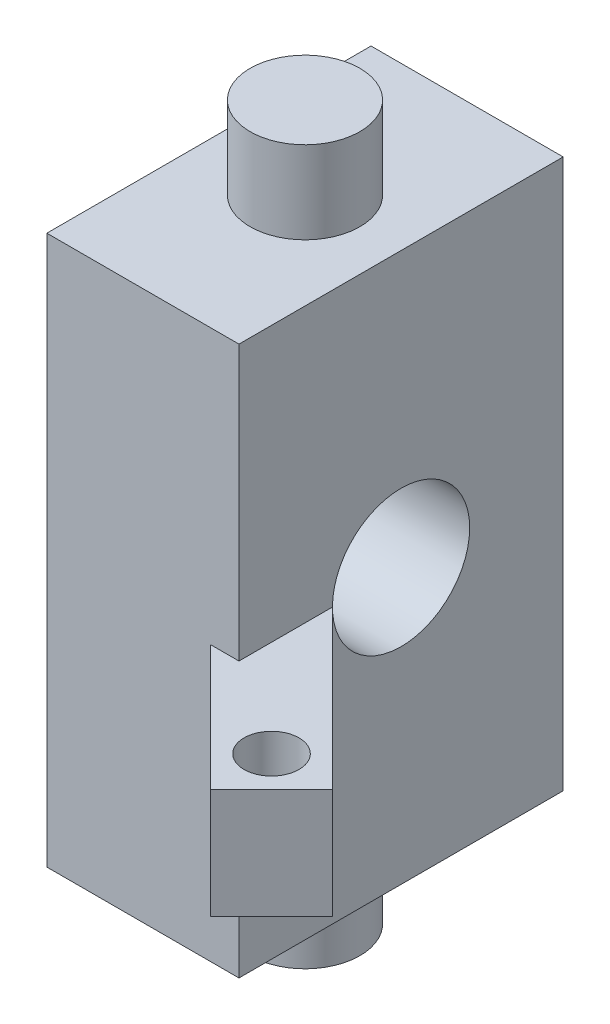
ISO-10303-21;
HEADER;
FILE_DESCRIPTION(('STEP AP214'),'2;1');
FILE_NAME('part.step','',(''),(''),'','','');
FILE_SCHEMA(('AUTOMOTIVE_DESIGN { 1 0 10303 214 1 1 1 1 }'));
ENDSEC;
DATA;
#1=APPLICATION_CONTEXT('core data for automotive mechanical design processes');
#2=APPLICATION_PROTOCOL_DEFINITION('international standard','automotive_design',2000,#1);
#3=PRODUCT_CONTEXT('',#1,'mechanical');
#4=PRODUCT('Part','Part','',(#3));
#5=PRODUCT_RELATED_PRODUCT_CATEGORY('part','',(#4));
#6=PRODUCT_DEFINITION_FORMATION('','',#4);
#7=PRODUCT_DEFINITION_CONTEXT('part definition',#1,'design');
#8=PRODUCT_DEFINITION('design','',#6,#7);
#9=PRODUCT_DEFINITION_SHAPE('','',#8);
#10=(LENGTH_UNIT() NAMED_UNIT(*) SI_UNIT(.MILLI.,.METRE.));
#11=(NAMED_UNIT(*) PLANE_ANGLE_UNIT() SI_UNIT($,.RADIAN.));
#12=(NAMED_UNIT(*) SI_UNIT($,.STERADIAN.) SOLID_ANGLE_UNIT());
#13=UNCERTAINTY_MEASURE_WITH_UNIT(LENGTH_MEASURE(1.E-05),#10,'distance_accuracy_value','');
#14=(GEOMETRIC_REPRESENTATION_CONTEXT(3) GLOBAL_UNCERTAINTY_ASSIGNED_CONTEXT((#13)) GLOBAL_UNIT_ASSIGNED_CONTEXT((#10,
#11,#12)) REPRESENTATION_CONTEXT('',''));
#15=CARTESIAN_POINT('',(0.,0.,0.));
#16=DIRECTION('',(0.,0.,1.));
#17=DIRECTION('',(1.,0.,0.));
#18=AXIS2_PLACEMENT_3D('',#15,#16,#17);
#19=CARTESIAN_POINT('',(0.,-16.51,7.499999986));
#20=DIRECTION('',(0.,0.,1.));
#21=DIRECTION('',(1.,0.,0.));
#22=AXIS2_PLACEMENT_3D('',#19,#20,#21);
#23=PLANE('',#22);
#24=DIRECTION('',(0.,1.,0.));
#25=VECTOR('',#24,1.);
#26=CARTESIAN_POINT('',(-4.445,-16.51,7.499999986));
#27=LINE('',#26,#25);
#28=CARTESIAN_POINT('',(-4.445,-12.7,7.499999986));
#29=VERTEX_POINT('',#28);
#30=CARTESIAN_POINT('',(-4.445,12.7,7.499999986));
#31=VERTEX_POINT('',#30);
#32=EDGE_CURVE('E153',#29,#31,#27,.T.);
#33=ORIENTED_EDGE('',*,*,#32,.F.);
#34=DIRECTION('',(1.,0.,0.));
#35=VECTOR('',#34,1.);
#36=CARTESIAN_POINT('',(0.,-12.7,7.499999986));
#37=LINE('',#36,#35);
#38=CARTESIAN_POINT('',(4.445,-12.7,7.499999986));
#39=VERTEX_POINT('',#38);
#40=EDGE_CURVE('E177',#29,#39,#37,.T.);
#41=ORIENTED_EDGE('',*,*,#40,.T.);
#42=DIRECTION('',(0.,1.,0.));
#43=VECTOR('',#42,1.);
#44=CARTESIAN_POINT('',(4.445,-16.51,7.499999986));
#45=LINE('',#44,#43);
#46=CARTESIAN_POINT('',(4.445,-5.08,7.499999986));
#47=VERTEX_POINT('',#46);
#48=EDGE_CURVE('E160',#39,#47,#45,.T.);
#49=ORIENTED_EDGE('',*,*,#48,.T.);
#50=DIRECTION('',(1.,0.,0.));
#51=VECTOR('',#50,1.);
#52=CARTESIAN_POINT('',(0.,-5.08,7.499999986));
#53=LINE('',#52,#51);
#54=CARTESIAN_POINT('',(3.12330113434391,-5.08,7.499999986));
#55=VERTEX_POINT('',#54);
#56=EDGE_CURVE('E152',#55,#47,#53,.T.);
#57=ORIENTED_EDGE('',*,*,#56,.F.);
#58=DIRECTION('',(0.,1.,0.));
#59=VECTOR('',#58,1.);
#60=CARTESIAN_POINT('',(3.12330113434391,-5.08,7.499999986));
#61=LINE('',#60,#59);
#62=CARTESIAN_POINT('',(3.12330113434391,0.,7.499999986));
#63=VERTEX_POINT('',#62);
#64=EDGE_CURVE('E143',#55,#63,#61,.T.);
#65=ORIENTED_EDGE('',*,*,#64,.T.);
#66=DIRECTION('',(1.,0.,0.));
#67=VECTOR('',#66,1.);
#68=CARTESIAN_POINT('',(0.,0.,7.499999986));
#69=LINE('',#68,#67);
#70=CARTESIAN_POINT('',(4.445,0.,7.499999986));
#71=VERTEX_POINT('',#70);
#72=EDGE_CURVE('E134',#63,#71,#69,.T.);
#73=ORIENTED_EDGE('',*,*,#72,.T.);
#74=CARTESIAN_POINT('',(4.445,12.7,7.499999986));
#75=VERTEX_POINT('',#74);
#76=EDGE_CURVE('E145',#71,#75,#45,.T.);
#77=ORIENTED_EDGE('',*,*,#76,.T.);
#78=DIRECTION('',(-1.,0.,0.));
#79=VECTOR('',#78,1.);
#80=CARTESIAN_POINT('',(0.,12.7,7.499999986));
#81=LINE('',#80,#79);
#82=EDGE_CURVE('E194',#75,#31,#81,.T.);
#83=ORIENTED_EDGE('',*,*,#82,.T.);
#84=EDGE_LOOP('',(#33,#41,#49,#57,#65,#73,#77,#83));
#85=FACE_BOUND('',#84,.T.);
#86=ADVANCED_FACE('F37',(#85),#23,.T.);
#87=CARTESIAN_POINT('',(4.445,-16.51,0.));
#88=DIRECTION('',(1.,0.,0.));
#89=DIRECTION('',(0.,0.,-1.));
#90=AXIS2_PLACEMENT_3D('',#87,#88,#89);
#91=PLANE('',#90);
#92=CARTESIAN_POINT('',(4.445,0.,0.));
#93=DIRECTION('',(1.,0.,0.));
#94=DIRECTION('',(0.,0.,-1.));
#95=AXIS2_PLACEMENT_3D('',#92,#93,#94);
#96=CIRCLE('',#95,3.175);
#97=CARTESIAN_POINT('',(4.445,-0.253739323234173,3.16484460216369));
#98=VERTEX_POINT('',#97);
#99=CARTESIAN_POINT('',(4.445,0.,3.175));
#100=VERTEX_POINT('',#99);
#101=EDGE_CURVE('E50',#98,#100,#96,.T.);
#102=ORIENTED_EDGE('',*,*,#101,.F.);
#103=DIRECTION('',(0.,1.,0.));
#104=VECTOR('',#103,1.);
#105=CARTESIAN_POINT('',(4.445,-5.08,3.16484460216369));
#106=LINE('',#105,#104);
#107=CARTESIAN_POINT('',(4.445,-5.08,3.16484460216369));
#108=VERTEX_POINT('',#107);
#109=EDGE_CURVE('E124',#108,#98,#106,.T.);
#110=ORIENTED_EDGE('',*,*,#109,.F.);
#111=DIRECTION('',(0.,0.,-1.));
#112=VECTOR('',#111,1.);
#113=CARTESIAN_POINT('',(4.445,-5.08,0.));
#114=LINE('',#113,#112);
#115=EDGE_CURVE('E212',#47,#108,#114,.T.);
#116=ORIENTED_EDGE('',*,*,#115,.F.);
#117=ORIENTED_EDGE('',*,*,#48,.F.);
#118=DIRECTION('',(0.,0.,-1.));
#119=VECTOR('',#118,1.);
#120=CARTESIAN_POINT('',(4.445,-12.7,0.));
#121=LINE('',#120,#119);
#122=CARTESIAN_POINT('',(4.445,-12.7,-7.499999986));
#123=VERTEX_POINT('',#122);
#124=EDGE_CURVE('E166',#39,#123,#121,.T.);
#125=ORIENTED_EDGE('',*,*,#124,.T.);
#126=DIRECTION('',(0.,1.,0.));
#127=VECTOR('',#126,1.);
#128=CARTESIAN_POINT('',(4.445,-16.51,-7.499999986));
#129=LINE('',#128,#127);
#130=CARTESIAN_POINT('',(4.445,12.7,-7.499999986));
#131=VERTEX_POINT('',#130);
#132=EDGE_CURVE('E158',#123,#131,#129,.T.);
#133=ORIENTED_EDGE('',*,*,#132,.T.);
#134=DIRECTION('',(0.,0.,1.));
#135=VECTOR('',#134,1.);
#136=CARTESIAN_POINT('',(4.445,12.7,0.));
#137=LINE('',#136,#135);
#138=EDGE_CURVE('E188',#131,#75,#137,.T.);
#139=ORIENTED_EDGE('',*,*,#138,.T.);
#140=ORIENTED_EDGE('',*,*,#76,.F.);
#141=DIRECTION('',(0.,0.,-1.));
#142=VECTOR('',#141,1.);
#143=CARTESIAN_POINT('',(4.445,0.,0.));
#144=LINE('',#143,#142);
#145=EDGE_CURVE('E132',#71,#100,#144,.T.);
#146=ORIENTED_EDGE('',*,*,#145,.T.);
#147=EDGE_LOOP('',(#102,#110,#116,#117,#125,#133,#139,#140,#146));
#148=FACE_BOUND('',#147,.T.);
#149=ADVANCED_FACE('F173',(#148),#91,.T.);
#150=CARTESIAN_POINT('',(-4.445,-16.51,0.));
#151=DIRECTION('',(-1.,0.,0.));
#152=DIRECTION('',(0.,0.,1.));
#153=AXIS2_PLACEMENT_3D('',#150,#151,#152);
#154=PLANE('',#153);
#155=CARTESIAN_POINT('',(-4.445,0.,0.));
#156=DIRECTION('',(1.,0.,0.));
#157=DIRECTION('',(0.,0.,-1.));
#158=AXIS2_PLACEMENT_3D('',#155,#156,#157);
#159=CIRCLE('',#158,3.175);
#160=CARTESIAN_POINT('',(-4.445,0.,-3.175));
#161=VERTEX_POINT('',#160);
#162=EDGE_CURVE('E125',#161,#161,#159,.T.);
#163=ORIENTED_EDGE('',*,*,#162,.T.);
#164=EDGE_LOOP('',(#163));
#165=FACE_BOUND('',#164,.T.);
#166=DIRECTION('',(0.,1.,0.));
#167=VECTOR('',#166,1.);
#168=CARTESIAN_POINT('',(-4.445,-16.51,-7.499999986));
#169=LINE('',#168,#167);
#170=CARTESIAN_POINT('',(-4.445,-12.7,-7.499999986));
#171=VERTEX_POINT('',#170);
#172=CARTESIAN_POINT('',(-4.445,12.7,-7.499999986));
#173=VERTEX_POINT('',#172);
#174=EDGE_CURVE('E156',#171,#173,#169,.T.);
#175=ORIENTED_EDGE('',*,*,#174,.F.);
#176=DIRECTION('',(0.,0.,1.));
#177=VECTOR('',#176,1.);
#178=CARTESIAN_POINT('',(-4.445,-12.7,0.));
#179=LINE('',#178,#177);
#180=EDGE_CURVE('E58',#171,#29,#179,.T.);
#181=ORIENTED_EDGE('',*,*,#180,.T.);
#182=ORIENTED_EDGE('',*,*,#32,.T.);
#183=DIRECTION('',(0.,0.,-1.));
#184=VECTOR('',#183,1.);
#185=CARTESIAN_POINT('',(-4.445,12.7,0.));
#186=LINE('',#185,#184);
#187=EDGE_CURVE('E186',#31,#173,#186,.T.);
#188=ORIENTED_EDGE('',*,*,#187,.T.);
#189=EDGE_LOOP('',(#175,#181,#182,#188));
#190=FACE_BOUND('',#189,.T.);
#191=ADVANCED_FACE('F190',(#165,#190),#154,.T.);
#192=CARTESIAN_POINT('',(0.,-16.51,-7.499999986));
#193=DIRECTION('',(0.,0.,1.));
#194=DIRECTION('',(1.,0.,0.));
#195=AXIS2_PLACEMENT_3D('',#192,#193,#194);
#196=PLANE('',#195);
#197=DIRECTION('',(1.,0.,0.));
#198=VECTOR('',#197,1.);
#199=CARTESIAN_POINT('',(0.,-12.7,-7.499999986));
#200=LINE('',#199,#198);
#201=EDGE_CURVE('E44',#171,#123,#200,.T.);
#202=ORIENTED_EDGE('',*,*,#201,.F.);
#203=ORIENTED_EDGE('',*,*,#174,.T.);
#204=DIRECTION('',(-1.,0.,0.));
#205=VECTOR('',#204,1.);
#206=CARTESIAN_POINT('',(0.,12.7,-7.499999986));
#207=LINE('',#206,#205);
#208=EDGE_CURVE('E155',#131,#173,#207,.T.);
#209=ORIENTED_EDGE('',*,*,#208,.F.);
#210=ORIENTED_EDGE('',*,*,#132,.F.);
#211=EDGE_LOOP('',(#202,#203,#209,#210));
#212=FACE_BOUND('',#211,.T.);
#213=ADVANCED_FACE('F180',(#212),#196,.F.);
#214=CARTESIAN_POINT('',(-2.18834942582803,-5.08,2.18834942582801));
#215=DIRECTION('',(0.707106781186551,0.,-0.707106781186544));
#216=DIRECTION('',(-0.707106781186544,0.,-0.707106781186551));
#217=AXIS2_PLACEMENT_3D('',#214,#215,#216);
#218=PLANE('',#217);
#219=DIRECTION('',(-0.707106781186544,0.,-0.707106781186551));
#220=VECTOR('',#219,1.);
#221=CARTESIAN_POINT('',(-2.18834942582803,0.,2.18834942582801));
#222=LINE('',#221,#220);
#223=CARTESIAN_POINT('',(8.93223605551142,0.,13.3089349071676));
#224=VERTEX_POINT('',#223);
#225=EDGE_CURVE('E136',#224,#63,#222,.T.);
#226=ORIENTED_EDGE('',*,*,#225,.T.);
#227=ORIENTED_EDGE('',*,*,#64,.F.);
#228=DIRECTION('',(-0.707106781186544,0.,-0.707106781186551));
#229=VECTOR('',#228,1.);
#230=CARTESIAN_POINT('',(-2.18834942582803,-5.08,2.18834942582801));
#231=LINE('',#230,#229);
#232=CARTESIAN_POINT('',(8.93223605551142,-5.08,13.3089349071676));
#233=VERTEX_POINT('',#232);
#234=EDGE_CURVE('E205',#233,#55,#231,.T.);
#235=ORIENTED_EDGE('',*,*,#234,.F.);
#236=DIRECTION('',(0.,1.,0.));
#237=VECTOR('',#236,1.);
#238=CARTESIAN_POINT('',(8.93223605551142,-5.08,13.3089349071676));
#239=LINE('',#238,#237);
#240=EDGE_CURVE('E149',#233,#224,#239,.T.);
#241=ORIENTED_EDGE('',*,*,#240,.T.);
#242=EDGE_LOOP('',(#226,#227,#235,#241));
#243=FACE_BOUND('',#242,.T.);
#244=ADVANCED_FACE('F221',(#243),#218,.F.);
#245=CARTESIAN_POINT('',(0.640077698918177,-5.08,-0.64007769891817));
#246=DIRECTION('',(-0.707106781186551,0.,0.707106781186544));
#247=DIRECTION('',(0.707106781186544,0.,0.707106781186551));
#248=AXIS2_PLACEMENT_3D('',#245,#246,#247);
#249=PLANE('',#248);
#250=ORIENTED_EDGE('',*,*,#109,.T.);
#251=CARTESIAN_POINT('',(1.28015539783634,0.,0.));
#252=DIRECTION('',(-0.707106781186551,0.,0.707106781186544));
#253=DIRECTION('',(0.707106781186544,0.,0.707106781186551));
#254=AXIS2_PLACEMENT_3D('',#251,#252,#253);
#255=ELLIPSE('',#254,4.49012806053455,3.175);
#256=CARTESIAN_POINT('',(4.45515539783631,0.,3.175));
#257=VERTEX_POINT('',#256);
#258=EDGE_CURVE('E112',#98,#257,#255,.T.);
#259=ORIENTED_EDGE('',*,*,#258,.T.);
#260=DIRECTION('',(0.707106781186544,0.,0.707106781186551));
#261=VECTOR('',#260,1.);
#262=CARTESIAN_POINT('',(0.640077698918177,0.,-0.64007769891817));
#263=LINE('',#262,#261);
#264=CARTESIAN_POINT('',(11.7606631802576,0.,10.4805077824214));
#265=VERTEX_POINT('',#264);
#266=EDGE_CURVE('E121',#257,#265,#263,.T.);
#267=ORIENTED_EDGE('',*,*,#266,.T.);
#268=DIRECTION('',(0.,1.,0.));
#269=VECTOR('',#268,1.);
#270=CARTESIAN_POINT('',(11.7606631802576,-5.08,10.4805077824214));
#271=LINE('',#270,#269);
#272=CARTESIAN_POINT('',(11.7606631802576,-5.08,10.4805077824214));
#273=VERTEX_POINT('',#272);
#274=EDGE_CURVE('E147',#273,#265,#271,.T.);
#275=ORIENTED_EDGE('',*,*,#274,.F.);
#276=DIRECTION('',(0.707106781186544,0.,0.707106781186551));
#277=VECTOR('',#276,1.);
#278=CARTESIAN_POINT('',(0.640077698918177,-5.08,-0.64007769891817));
#279=LINE('',#278,#277);
#280=EDGE_CURVE('E210',#108,#273,#279,.T.);
#281=ORIENTED_EDGE('',*,*,#280,.F.);
#282=EDGE_LOOP('',(#250,#259,#267,#275,#281));
#283=FACE_BOUND('',#282,.T.);
#284=ADVANCED_FACE('F119',(#283),#249,.F.);
#285=CARTESIAN_POINT('',(8.90960863851346,-5.08,10.4578803654234));
#286=DIRECTION('',(0.,1.,0.));
#287=DIRECTION('',(0.,0.,1.));
#288=AXIS2_PLACEMENT_3D('',#285,#286,#287);
#289=CYLINDRICAL_SURFACE('',#288,1.27);
#290=CARTESIAN_POINT('',(8.90960863851346,-5.08,10.4578803654234));
#291=DIRECTION('',(0.,1.,0.));
#292=DIRECTION('',(0.,0.,1.));
#293=AXIS2_PLACEMENT_3D('',#290,#291,#292);
#294=CIRCLE('',#293,1.27);
#295=CARTESIAN_POINT('',(8.90960863851346,-5.08,11.7278803654234));
#296=VERTEX_POINT('',#295);
#297=EDGE_CURVE('E142',#296,#296,#294,.T.);
#298=ORIENTED_EDGE('',*,*,#297,.F.);
#299=EDGE_LOOP('',(#298));
#300=FACE_BOUND('',#299,.T.);
#301=CARTESIAN_POINT('',(8.90960863851346,0.,10.4578803654234));
#302=DIRECTION('',(0.,1.,0.));
#303=DIRECTION('',(0.,0.,1.));
#304=AXIS2_PLACEMENT_3D('',#301,#302,#303);
#305=CIRCLE('',#304,1.27);
#306=CARTESIAN_POINT('',(8.90960863851346,0.,11.7278803654234));
#307=VERTEX_POINT('',#306);
#308=EDGE_CURVE('E202',#307,#307,#305,.T.);
#309=ORIENTED_EDGE('',*,*,#308,.T.);
#310=EDGE_LOOP('',(#309));
#311=FACE_BOUND('',#310,.T.);
#312=ADVANCED_FACE('F233',(#300,#311),#289,.F.);
#313=CARTESIAN_POINT('',(11.1205854813394,-5.08,11.1205854813396));
#314=DIRECTION('',(-0.707106781186544,0.,-0.707106781186551));
#315=DIRECTION('',(-0.707106781186551,0.,0.707106781186544));
#316=AXIS2_PLACEMENT_3D('',#313,#314,#315);
#317=PLANE('',#316);
#318=DIRECTION('',(-0.707106781186551,0.,0.707106781186544));
#319=VECTOR('',#318,1.);
#320=CARTESIAN_POINT('',(11.1205854813394,0.,11.1205854813396));
#321=LINE('',#320,#319);
#322=EDGE_CURVE('E131',#265,#224,#321,.T.);
#323=ORIENTED_EDGE('',*,*,#322,.T.);
#324=ORIENTED_EDGE('',*,*,#240,.F.);
#325=DIRECTION('',(-0.707106781186551,0.,0.707106781186544));
#326=VECTOR('',#325,1.);
#327=CARTESIAN_POINT('',(11.1205854813394,-5.08,11.1205854813396));
#328=LINE('',#327,#326);
#329=EDGE_CURVE('E208',#273,#233,#328,.T.);
#330=ORIENTED_EDGE('',*,*,#329,.F.);
#331=ORIENTED_EDGE('',*,*,#274,.T.);
#332=EDGE_LOOP('',(#323,#324,#330,#331));
#333=FACE_BOUND('',#332,.T.);
#334=ADVANCED_FACE('F231',(#333),#317,.F.);
#335=CARTESIAN_POINT('',(0.,-5.08,0.));
#336=DIRECTION('',(0.,1.,0.));
#337=DIRECTION('',(0.,0.,1.));
#338=AXIS2_PLACEMENT_3D('',#335,#336,#337);
#339=PLANE('',#338);
#340=ORIENTED_EDGE('',*,*,#297,.T.);
#341=EDGE_LOOP('',(#340));
#342=FACE_BOUND('',#341,.T.);
#343=ORIENTED_EDGE('',*,*,#234,.T.);
#344=ORIENTED_EDGE('',*,*,#56,.T.);
#345=ORIENTED_EDGE('',*,*,#115,.T.);
#346=ORIENTED_EDGE('',*,*,#280,.T.);
#347=ORIENTED_EDGE('',*,*,#329,.T.);
#348=EDGE_LOOP('',(#343,#344,#345,#346,#347));
#349=FACE_BOUND('',#348,.T.);
#350=ADVANCED_FACE('F228',(#342,#349),#339,.F.);
#351=CARTESIAN_POINT('',(0.,0.,0.));
#352=DIRECTION('',(0.,1.,0.));
#353=DIRECTION('',(0.,0.,1.));
#354=AXIS2_PLACEMENT_3D('',#351,#352,#353);
#355=PLANE('',#354);
#356=DIRECTION('',(1.,0.,0.));
#357=VECTOR('',#356,1.);
#358=CARTESIAN_POINT('',(-4.445,0.,3.175));
#359=LINE('',#358,#357);
#360=EDGE_CURVE('E11',#100,#257,#359,.T.);
#361=ORIENTED_EDGE('',*,*,#360,.F.);
#362=ORIENTED_EDGE('',*,*,#145,.F.);
#363=ORIENTED_EDGE('',*,*,#72,.F.);
#364=ORIENTED_EDGE('',*,*,#225,.F.);
#365=ORIENTED_EDGE('',*,*,#322,.F.);
#366=ORIENTED_EDGE('',*,*,#266,.F.);
#367=EDGE_LOOP('',(#361,#362,#363,#364,#365,#366));
#368=FACE_BOUND('',#367,.T.);
#369=ORIENTED_EDGE('',*,*,#308,.F.);
#370=EDGE_LOOP('',(#369));
#371=FACE_BOUND('',#370,.T.);
#372=ADVANCED_FACE('F128',(#368,#371),#355,.T.);
#373=CARTESIAN_POINT('',(0.,0.,0.));
#374=DIRECTION('',(0.,-1.,0.));
#375=DIRECTION('',(0.,0.,-1.));
#376=AXIS2_PLACEMENT_3D('',#373,#374,#375);
#377=CYLINDRICAL_SURFACE('',#376,2.54);
#378=CARTESIAN_POINT('',(0.,16.51,0.));
#379=DIRECTION('',(0.,-1.,0.));
#380=DIRECTION('',(0.,0.,-1.));
#381=AXIS2_PLACEMENT_3D('',#378,#379,#380);
#382=CIRCLE('',#381,2.54);
#383=CARTESIAN_POINT('',(0.,16.51,-2.54));
#384=VERTEX_POINT('',#383);
#385=EDGE_CURVE('E197',#384,#384,#382,.T.);
#386=ORIENTED_EDGE('',*,*,#385,.T.);
#387=EDGE_LOOP('',(#386));
#388=FACE_BOUND('',#387,.T.);
#389=CARTESIAN_POINT('',(0.,12.7,0.));
#390=DIRECTION('',(0.,-1.,0.));
#391=DIRECTION('',(0.,0.,-1.));
#392=AXIS2_PLACEMENT_3D('',#389,#390,#391);
#393=CIRCLE('',#392,2.54);
#394=CARTESIAN_POINT('',(0.,12.7,-2.54));
#395=VERTEX_POINT('',#394);
#396=EDGE_CURVE('E192',#395,#395,#393,.T.);
#397=ORIENTED_EDGE('',*,*,#396,.F.);
#398=EDGE_LOOP('',(#397));
#399=FACE_BOUND('',#398,.T.);
#400=ADVANCED_FACE('F273',(#388,#399),#377,.T.);
#401=CARTESIAN_POINT('',(0.,12.7,2.54));
#402=DIRECTION('',(0.,1.,0.));
#403=DIRECTION('',(0.,0.,1.));
#404=AXIS2_PLACEMENT_3D('',#401,#402,#403);
#405=PLANE('',#404);
#406=ORIENTED_EDGE('',*,*,#138,.F.);
#407=ORIENTED_EDGE('',*,*,#208,.T.);
#408=ORIENTED_EDGE('',*,*,#187,.F.);
#409=ORIENTED_EDGE('',*,*,#82,.F.);
#410=EDGE_LOOP('',(#406,#407,#408,#409));
#411=FACE_BOUND('',#410,.T.);
#412=ORIENTED_EDGE('',*,*,#396,.T.);
#413=EDGE_LOOP('',(#412));
#414=FACE_BOUND('',#413,.T.);
#415=ADVANCED_FACE('F184',(#411,#414),#405,.T.);
#416=CARTESIAN_POINT('',(0.,16.51,0.));
#417=DIRECTION('',(0.,1.,0.));
#418=DIRECTION('',(0.,0.,1.));
#419=AXIS2_PLACEMENT_3D('',#416,#417,#418);
#420=PLANE('',#419);
#421=ORIENTED_EDGE('',*,*,#385,.F.);
#422=EDGE_LOOP('',(#421));
#423=FACE_BOUND('',#422,.T.);
#424=ADVANCED_FACE('F261',(#423),#420,.T.);
#425=CARTESIAN_POINT('',(0.,0.,0.));
#426=DIRECTION('',(0.,-1.,0.));
#427=DIRECTION('',(0.,0.,-1.));
#428=AXIS2_PLACEMENT_3D('',#425,#426,#427);
#429=CYLINDRICAL_SURFACE('',#428,2.54);
#430=CARTESIAN_POINT('',(0.,-12.7,0.));
#431=DIRECTION('',(0.,-1.,0.));
#432=DIRECTION('',(0.,0.,-1.));
#433=AXIS2_PLACEMENT_3D('',#430,#431,#432);
#434=CIRCLE('',#433,2.54);
#435=CARTESIAN_POINT('',(0.,-12.7,-2.54));
#436=VERTEX_POINT('',#435);
#437=EDGE_CURVE('E387',#436,#436,#434,.T.);
#438=ORIENTED_EDGE('',*,*,#437,.T.);
#439=EDGE_LOOP('',(#438));
#440=FACE_BOUND('',#439,.T.);
#441=CARTESIAN_POINT('',(0.,-16.51,0.));
#442=DIRECTION('',(0.,-1.,0.));
#443=DIRECTION('',(0.,0.,-1.));
#444=AXIS2_PLACEMENT_3D('',#441,#442,#443);
#445=CIRCLE('',#444,2.54);
#446=CARTESIAN_POINT('',(0.,-16.51,-2.54));
#447=VERTEX_POINT('',#446);
#448=EDGE_CURVE('E390',#447,#447,#445,.T.);
#449=ORIENTED_EDGE('',*,*,#448,.F.);
#450=EDGE_LOOP('',(#449));
#451=FACE_BOUND('',#450,.T.);
#452=ADVANCED_FACE('F263',(#440,#451),#429,.T.);
#453=CARTESIAN_POINT('',(0.,-12.7,2.54));
#454=DIRECTION('',(0.,-1.,0.));
#455=DIRECTION('',(0.,0.,-1.));
#456=AXIS2_PLACEMENT_3D('',#453,#454,#455);
#457=PLANE('',#456);
#458=ORIENTED_EDGE('',*,*,#180,.F.);
#459=ORIENTED_EDGE('',*,*,#201,.T.);
#460=ORIENTED_EDGE('',*,*,#124,.F.);
#461=ORIENTED_EDGE('',*,*,#40,.F.);
#462=EDGE_LOOP('',(#458,#459,#460,#461));
#463=FACE_BOUND('',#462,.T.);
#464=ORIENTED_EDGE('',*,*,#437,.F.);
#465=EDGE_LOOP('',(#464));
#466=FACE_BOUND('',#465,.T.);
#467=ADVANCED_FACE('F164',(#463,#466),#457,.T.);
#468=CARTESIAN_POINT('',(0.,-16.51,0.));
#469=DIRECTION('',(0.,1.,0.));
#470=DIRECTION('',(0.,0.,1.));
#471=AXIS2_PLACEMENT_3D('',#468,#469,#470);
#472=PLANE('',#471);
#473=ORIENTED_EDGE('',*,*,#448,.T.);
#474=EDGE_LOOP('',(#473));
#475=FACE_BOUND('',#474,.T.);
#476=ADVANCED_FACE('F257',(#475),#472,.F.);
#477=CARTESIAN_POINT('',(-4.445,0.,0.));
#478=DIRECTION('',(1.,0.,0.));
#479=DIRECTION('',(0.,0.,-1.));
#480=AXIS2_PLACEMENT_3D('',#477,#478,#479);
#481=CYLINDRICAL_SURFACE('',#480,3.175);
#482=ORIENTED_EDGE('',*,*,#101,.T.);
#483=ORIENTED_EDGE('',*,*,#360,.T.);
#484=ORIENTED_EDGE('',*,*,#258,.F.);
#485=EDGE_LOOP('',(#482,#483,#484));
#486=FACE_BOUND('',#485,.T.);
#487=ORIENTED_EDGE('',*,*,#162,.F.);
#488=EDGE_LOOP('',(#487));
#489=FACE_BOUND('',#488,.T.);
#490=ADVANCED_FACE('F110',(#486,#489),#481,.F.);
#491=CLOSED_SHELL('',(#86,#149,#191,#213,#244,#284,#312,#334,#350,#372,#400,#415,#424,#452,#467,
#476,#490));
#492=MANIFOLD_SOLID_BREP('B2',#491);
#493=ADVANCED_BREP_SHAPE_REPRESENTATION('',(#18,#492),#14);
#494=SHAPE_DEFINITION_REPRESENTATION(#9,#493);
ENDSEC;
END-ISO-10303-21;
